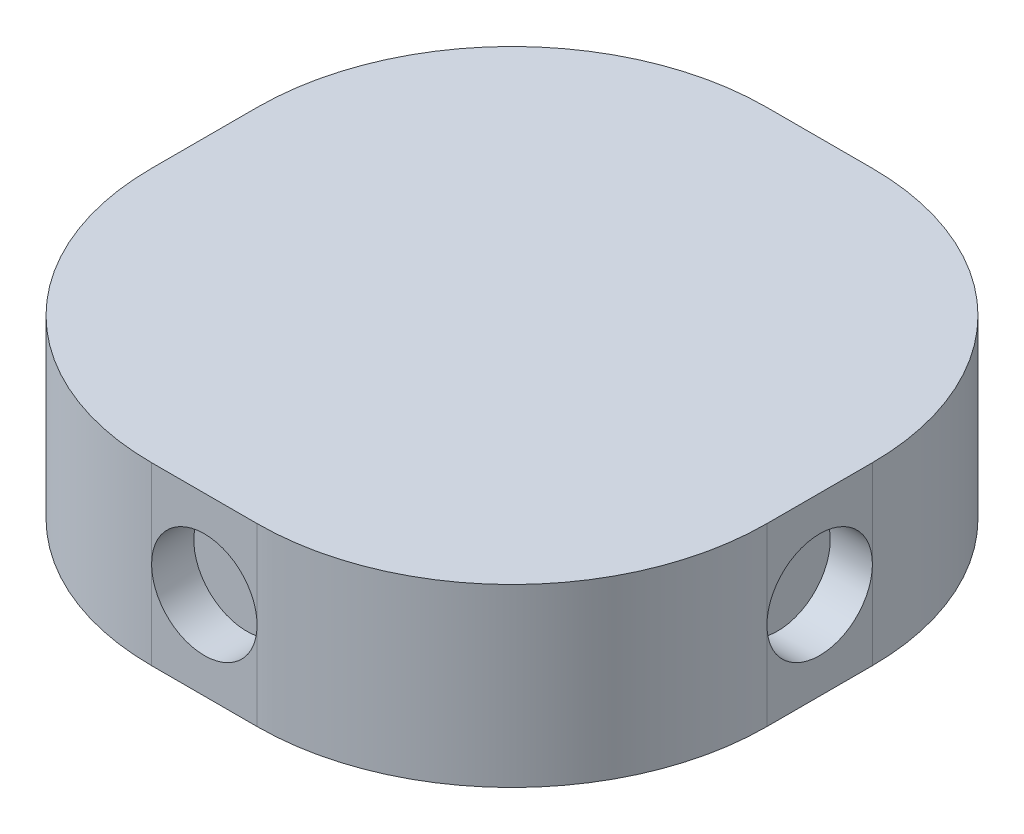
ISO-10303-21;
HEADER;
FILE_DESCRIPTION(('STEP AP214'),'2;1');
FILE_NAME('part.step','',(''),(''),'','','');
FILE_SCHEMA(('AUTOMOTIVE_DESIGN { 1 0 10303 214 1 1 1 1 }'));
ENDSEC;
DATA;
#1=APPLICATION_CONTEXT('core data for automotive mechanical design processes');
#2=APPLICATION_PROTOCOL_DEFINITION('international standard','automotive_design',2000,#1);
#3=PRODUCT_CONTEXT('',#1,'mechanical');
#4=PRODUCT('Part','Part','',(#3));
#5=PRODUCT_RELATED_PRODUCT_CATEGORY('part','',(#4));
#6=PRODUCT_DEFINITION_FORMATION('','',#4);
#7=PRODUCT_DEFINITION_CONTEXT('part definition',#1,'design');
#8=PRODUCT_DEFINITION('design','',#6,#7);
#9=PRODUCT_DEFINITION_SHAPE('','',#8);
#10=(LENGTH_UNIT() NAMED_UNIT(*) SI_UNIT(.MILLI.,.METRE.));
#11=(NAMED_UNIT(*) PLANE_ANGLE_UNIT() SI_UNIT($,.RADIAN.));
#12=(NAMED_UNIT(*) SI_UNIT($,.STERADIAN.) SOLID_ANGLE_UNIT());
#13=UNCERTAINTY_MEASURE_WITH_UNIT(LENGTH_MEASURE(1.E-05),#10,'distance_accuracy_value','');
#14=(GEOMETRIC_REPRESENTATION_CONTEXT(3) GLOBAL_UNCERTAINTY_ASSIGNED_CONTEXT((#13)) GLOBAL_UNIT_ASSIGNED_CONTEXT((#10,
#11,#12)) REPRESENTATION_CONTEXT('',''));
#15=CARTESIAN_POINT('',(0.,0.,0.));
#16=DIRECTION('',(0.,0.,1.));
#17=DIRECTION('',(1.,0.,0.));
#18=AXIS2_PLACEMENT_3D('',#15,#16,#17);
#19=CARTESIAN_POINT('',(-128.067602033553,5.,163.739757522464));
#20=DIRECTION('',(0.,0.,-1.));
#21=DIRECTION('',(-1.,0.,0.));
#22=AXIS2_PLACEMENT_3D('',#19,#20,#21);
#23=PLANE('',#22);
#24=DIRECTION('',(0.,-1.,0.));
#25=VECTOR('',#24,1.);
#26=CARTESIAN_POINT('',(-128.067602033553,5.,163.739757522464));
#27=LINE('',#26,#25);
#28=CARTESIAN_POINT('',(-128.067602033553,5.,163.739757522464));
#29=VERTEX_POINT('',#28);
#30=CARTESIAN_POINT('',(-128.067602033553,2.5,163.739757522464));
#31=VERTEX_POINT('',#30);
#32=EDGE_CURVE('E133',#29,#31,#27,.T.);
#33=ORIENTED_EDGE('',*,*,#32,.T.);
#34=CARTESIAN_POINT('',(-126.567602033553,2.5,163.739757522464));
#35=DIRECTION('',(0.,0.,1.));
#36=DIRECTION('',(1.,0.,0.));
#37=AXIS2_PLACEMENT_3D('',#34,#35,#36);
#38=CIRCLE('',#37,1.5);
#39=CARTESIAN_POINT('',(-125.067602033553,2.5,163.739757522464));
#40=VERTEX_POINT('',#39);
#41=EDGE_CURVE('E47',#40,#31,#38,.T.);
#42=ORIENTED_EDGE('',*,*,#41,.F.);
#43=DIRECTION('',(0.,-1.,0.));
#44=VECTOR('',#43,1.);
#45=CARTESIAN_POINT('',(-125.067602033553,5.,163.739757522464));
#46=LINE('',#45,#44);
#47=CARTESIAN_POINT('',(-125.067602033553,5.,163.739757522464));
#48=VERTEX_POINT('',#47);
#49=EDGE_CURVE('E130',#48,#40,#46,.T.);
#50=ORIENTED_EDGE('',*,*,#49,.F.);
#51=DIRECTION('',(1.,0.,0.));
#52=VECTOR('',#51,1.);
#53=CARTESIAN_POINT('',(-128.067602033553,5.,163.739757522464));
#54=LINE('',#53,#52);
#55=EDGE_CURVE('E242',#29,#48,#54,.T.);
#56=ORIENTED_EDGE('',*,*,#55,.F.);
#57=EDGE_LOOP('',(#33,#42,#50,#56));
#58=FACE_BOUND('',#57,.T.);
#59=ADVANCED_FACE('F33',(#58),#23,.F.);
#60=CARTESIAN_POINT('',(-135.317602033553,5.,156.489757522464));
#61=DIRECTION('',(1.,0.,0.));
#62=DIRECTION('',(0.,0.,-1.));
#63=AXIS2_PLACEMENT_3D('',#60,#61,#62);
#64=PLANE('',#63);
#65=DIRECTION('',(0.,-1.,0.));
#66=VECTOR('',#65,1.);
#67=CARTESIAN_POINT('',(-135.317602033553,5.,153.489757522464));
#68=LINE('',#67,#66);
#69=CARTESIAN_POINT('',(-135.317602033553,5.,153.489757522464));
#70=VERTEX_POINT('',#69);
#71=CARTESIAN_POINT('',(-135.317602033553,2.5,153.489757522464));
#72=VERTEX_POINT('',#71);
#73=EDGE_CURVE('E41',#70,#72,#68,.T.);
#74=ORIENTED_EDGE('',*,*,#73,.T.);
#75=CARTESIAN_POINT('',(-135.317602033553,2.5,154.989757522464));
#76=DIRECTION('',(-1.,0.,0.));
#77=DIRECTION('',(0.,0.,1.));
#78=AXIS2_PLACEMENT_3D('',#75,#76,#77);
#79=CIRCLE('',#78,1.50000000000003);
#80=CARTESIAN_POINT('',(-135.317602033553,2.5,156.489757522464));
#81=VERTEX_POINT('',#80);
#82=EDGE_CURVE('E54',#81,#72,#79,.T.);
#83=ORIENTED_EDGE('',*,*,#82,.F.);
#84=DIRECTION('',(0.,-1.,0.));
#85=VECTOR('',#84,1.);
#86=CARTESIAN_POINT('',(-135.317602033553,5.,156.489757522464));
#87=LINE('',#86,#85);
#88=CARTESIAN_POINT('',(-135.317602033553,5.,156.489757522464));
#89=VERTEX_POINT('',#88);
#90=EDGE_CURVE('E154',#89,#81,#87,.T.);
#91=ORIENTED_EDGE('',*,*,#90,.F.);
#92=DIRECTION('',(0.,0.,1.));
#93=VECTOR('',#92,1.);
#94=CARTESIAN_POINT('',(-135.317602033553,5.,156.489757522464));
#95=LINE('',#94,#93);
#96=EDGE_CURVE('E246',#70,#89,#95,.T.);
#97=ORIENTED_EDGE('',*,*,#96,.F.);
#98=EDGE_LOOP('',(#74,#83,#91,#97));
#99=FACE_BOUND('',#98,.T.);
#100=ADVANCED_FACE('F265',(#99),#64,.F.);
#101=CARTESIAN_POINT('',(-117.817602033553,5.,156.489757522464));
#102=DIRECTION('',(-1.,0.,0.));
#103=DIRECTION('',(0.,0.,1.));
#104=AXIS2_PLACEMENT_3D('',#101,#102,#103);
#105=PLANE('',#104);
#106=DIRECTION('',(0.,-1.,0.));
#107=VECTOR('',#106,1.);
#108=CARTESIAN_POINT('',(-117.817602033553,5.,156.489757522464));
#109=LINE('',#108,#107);
#110=CARTESIAN_POINT('',(-117.817602033553,5.,156.489757522464));
#111=VERTEX_POINT('',#110);
#112=CARTESIAN_POINT('',(-117.817602033553,2.5,156.489757522464));
#113=VERTEX_POINT('',#112);
#114=EDGE_CURVE('E143',#111,#113,#109,.T.);
#115=ORIENTED_EDGE('',*,*,#114,.T.);
#116=CARTESIAN_POINT('',(-117.817602033553,2.5,154.989757522464));
#117=DIRECTION('',(1.,0.,0.));
#118=DIRECTION('',(0.,0.,-1.));
#119=AXIS2_PLACEMENT_3D('',#116,#117,#118);
#120=CIRCLE('',#119,1.50000000000003);
#121=CARTESIAN_POINT('',(-117.817602033553,2.5,153.489757522464));
#122=VERTEX_POINT('',#121);
#123=EDGE_CURVE('E251',#122,#113,#120,.T.);
#124=ORIENTED_EDGE('',*,*,#123,.F.);
#125=DIRECTION('',(0.,-1.,0.));
#126=VECTOR('',#125,1.);
#127=CARTESIAN_POINT('',(-117.817602033553,5.,153.489757522464));
#128=LINE('',#127,#126);
#129=CARTESIAN_POINT('',(-117.817602033553,5.,153.489757522464));
#130=VERTEX_POINT('',#129);
#131=EDGE_CURVE('E211',#130,#122,#128,.T.);
#132=ORIENTED_EDGE('',*,*,#131,.F.);
#133=DIRECTION('',(0.,0.,-1.));
#134=VECTOR('',#133,1.);
#135=CARTESIAN_POINT('',(-117.817602033553,5.,156.489757522464));
#136=LINE('',#135,#134);
#137=EDGE_CURVE('E238',#111,#130,#136,.T.);
#138=ORIENTED_EDGE('',*,*,#137,.F.);
#139=EDGE_LOOP('',(#115,#124,#132,#138));
#140=FACE_BOUND('',#139,.T.);
#141=ADVANCED_FACE('F274',(#140),#105,.F.);
#142=CARTESIAN_POINT('',(-128.067602033553,5.,146.239757522464));
#143=DIRECTION('',(0.,0.,1.));
#144=DIRECTION('',(1.,0.,0.));
#145=AXIS2_PLACEMENT_3D('',#142,#143,#144);
#146=PLANE('',#145);
#147=DIRECTION('',(0.,-1.,0.));
#148=VECTOR('',#147,1.);
#149=CARTESIAN_POINT('',(-125.067602033553,5.,146.239757522464));
#150=LINE('',#149,#148);
#151=CARTESIAN_POINT('',(-125.067602033553,5.,146.239757522464));
#152=VERTEX_POINT('',#151);
#153=CARTESIAN_POINT('',(-125.067602033553,2.5,146.239757522464));
#154=VERTEX_POINT('',#153);
#155=EDGE_CURVE('E208',#152,#154,#150,.T.);
#156=ORIENTED_EDGE('',*,*,#155,.T.);
#157=CARTESIAN_POINT('',(-126.567602033553,2.5,146.239757522464));
#158=DIRECTION('',(0.,0.,-1.));
#159=DIRECTION('',(-1.,0.,0.));
#160=AXIS2_PLACEMENT_3D('',#157,#158,#159);
#161=CIRCLE('',#160,1.5);
#162=CARTESIAN_POINT('',(-128.067602033553,2.5,146.239757522464));
#163=VERTEX_POINT('',#162);
#164=EDGE_CURVE('E186',#163,#154,#161,.T.);
#165=ORIENTED_EDGE('',*,*,#164,.F.);
#166=DIRECTION('',(0.,-1.,0.));
#167=VECTOR('',#166,1.);
#168=CARTESIAN_POINT('',(-128.067602033553,5.,146.239757522464));
#169=LINE('',#168,#167);
#170=CARTESIAN_POINT('',(-128.067602033553,5.,146.239757522464));
#171=VERTEX_POINT('',#170);
#172=EDGE_CURVE('E205',#171,#163,#169,.T.);
#173=ORIENTED_EDGE('',*,*,#172,.F.);
#174=DIRECTION('',(-1.,0.,0.));
#175=VECTOR('',#174,1.);
#176=CARTESIAN_POINT('',(-128.067602033553,5.,146.239757522464));
#177=LINE('',#176,#175);
#178=EDGE_CURVE('E189',#152,#171,#177,.T.);
#179=ORIENTED_EDGE('',*,*,#178,.F.);
#180=EDGE_LOOP('',(#156,#165,#173,#179));
#181=FACE_BOUND('',#180,.T.);
#182=ADVANCED_FACE('F232',(#181),#146,.F.);
#183=CARTESIAN_POINT('',(-128.067602033553,5.,153.489757522464));
#184=DIRECTION('',(0.,-1.,0.));
#185=DIRECTION('',(0.,0.,-1.));
#186=AXIS2_PLACEMENT_3D('',#183,#184,#185);
#187=CYLINDRICAL_SURFACE('',#186,7.25000000000001);
#188=CARTESIAN_POINT('',(-128.067602033553,0.,153.489757522464));
#189=DIRECTION('',(0.,1.,0.));
#190=DIRECTION('',(0.,0.,-1.));
#191=AXIS2_PLACEMENT_3D('',#188,#189,#190);
#192=CIRCLE('',#191,7.25000000000001);
#193=CARTESIAN_POINT('',(-128.067602033553,0.,146.239757522464));
#194=VERTEX_POINT('',#193);
#195=CARTESIAN_POINT('',(-135.317602033553,0.,153.489757522464));
#196=VERTEX_POINT('',#195);
#197=EDGE_CURVE('E175',#194,#196,#192,.T.);
#198=ORIENTED_EDGE('',*,*,#197,.T.);
#199=EDGE_CURVE('E156',#72,#196,#68,.T.);
#200=ORIENTED_EDGE('',*,*,#199,.F.);
#201=ORIENTED_EDGE('',*,*,#73,.F.);
#202=CARTESIAN_POINT('',(-128.067602033553,5.,153.489757522464));
#203=DIRECTION('',(0.,1.,0.));
#204=DIRECTION('',(0.,0.,-1.));
#205=AXIS2_PLACEMENT_3D('',#202,#203,#204);
#206=CIRCLE('',#205,7.25000000000001);
#207=EDGE_CURVE('E204',#171,#70,#206,.T.);
#208=ORIENTED_EDGE('',*,*,#207,.F.);
#209=ORIENTED_EDGE('',*,*,#172,.T.);
#210=EDGE_CURVE('E181',#163,#194,#169,.T.);
#211=ORIENTED_EDGE('',*,*,#210,.T.);
#212=EDGE_LOOP('',(#198,#200,#201,#208,#209,#211));
#213=FACE_BOUND('',#212,.T.);
#214=ADVANCED_FACE('F35',(#213),#187,.T.);
#215=CARTESIAN_POINT('',(-135.317602033553,0.,156.489757522464));
#216=VERTEX_POINT('',#215);
#217=EDGE_CURVE('E153',#81,#216,#87,.T.);
#218=ORIENTED_EDGE('',*,*,#217,.F.);
#219=EDGE_CURVE('E168',#72,#81,#79,.T.);
#220=ORIENTED_EDGE('',*,*,#219,.F.);
#221=ORIENTED_EDGE('',*,*,#199,.T.);
#222=DIRECTION('',(0.,0.,1.));
#223=VECTOR('',#222,1.);
#224=CARTESIAN_POINT('',(-135.317602033553,0.,156.489757522464));
#225=LINE('',#224,#223);
#226=EDGE_CURVE('E166',#196,#216,#225,.T.);
#227=ORIENTED_EDGE('',*,*,#226,.T.);
#228=EDGE_LOOP('',(#218,#220,#221,#227));
#229=FACE_BOUND('',#228,.T.);
#230=ADVANCED_FACE('F165',(#229),#64,.F.);
#231=CARTESIAN_POINT('',(-128.067602033553,5.,156.489757522464));
#232=DIRECTION('',(0.,-1.,0.));
#233=DIRECTION('',(0.,0.,-1.));
#234=AXIS2_PLACEMENT_3D('',#231,#232,#233);
#235=CYLINDRICAL_SURFACE('',#234,7.25000000000001);
#236=CARTESIAN_POINT('',(-128.067602033553,0.,156.489757522464));
#237=DIRECTION('',(0.,1.,0.));
#238=DIRECTION('',(0.,0.,-1.));
#239=AXIS2_PLACEMENT_3D('',#236,#237,#238);
#240=CIRCLE('',#239,7.25000000000001);
#241=CARTESIAN_POINT('',(-128.067602033553,0.,163.739757522464));
#242=VERTEX_POINT('',#241);
#243=EDGE_CURVE('E177',#216,#242,#240,.T.);
#244=ORIENTED_EDGE('',*,*,#243,.T.);
#245=EDGE_CURVE('E148',#31,#242,#27,.T.);
#246=ORIENTED_EDGE('',*,*,#245,.F.);
#247=ORIENTED_EDGE('',*,*,#32,.F.);
#248=CARTESIAN_POINT('',(-128.067602033553,5.,156.489757522464));
#249=DIRECTION('',(0.,1.,0.));
#250=DIRECTION('',(0.,0.,-1.));
#251=AXIS2_PLACEMENT_3D('',#248,#249,#250);
#252=CIRCLE('',#251,7.25000000000001);
#253=EDGE_CURVE('E244',#89,#29,#252,.T.);
#254=ORIENTED_EDGE('',*,*,#253,.F.);
#255=ORIENTED_EDGE('',*,*,#90,.T.);
#256=ORIENTED_EDGE('',*,*,#217,.T.);
#257=EDGE_LOOP('',(#244,#246,#247,#254,#255,#256));
#258=FACE_BOUND('',#257,.T.);
#259=ADVANCED_FACE('F268',(#258),#235,.T.);
#260=CARTESIAN_POINT('',(-125.067602033553,0.,163.739757522464));
#261=VERTEX_POINT('',#260);
#262=EDGE_CURVE('E136',#40,#261,#46,.T.);
#263=ORIENTED_EDGE('',*,*,#262,.F.);
#264=EDGE_CURVE('E119',#31,#40,#38,.T.);
#265=ORIENTED_EDGE('',*,*,#264,.F.);
#266=ORIENTED_EDGE('',*,*,#245,.T.);
#267=DIRECTION('',(1.,0.,0.));
#268=VECTOR('',#267,1.);
#269=CARTESIAN_POINT('',(-128.067602033553,0.,163.739757522464));
#270=LINE('',#269,#268);
#271=EDGE_CURVE('E139',#242,#261,#270,.T.);
#272=ORIENTED_EDGE('',*,*,#271,.T.);
#273=EDGE_LOOP('',(#263,#265,#266,#272));
#274=FACE_BOUND('',#273,.T.);
#275=ADVANCED_FACE('F137',(#274),#23,.F.);
#276=CARTESIAN_POINT('',(-125.067602033553,5.,156.489757522464));
#277=DIRECTION('',(0.,-1.,0.));
#278=DIRECTION('',(0.,0.,-1.));
#279=AXIS2_PLACEMENT_3D('',#276,#277,#278);
#280=CYLINDRICAL_SURFACE('',#279,7.25);
#281=CARTESIAN_POINT('',(-125.067602033553,0.,156.489757522464));
#282=DIRECTION('',(0.,1.,0.));
#283=DIRECTION('',(0.,0.,1.));
#284=AXIS2_PLACEMENT_3D('',#281,#282,#283);
#285=CIRCLE('',#284,7.25);
#286=CARTESIAN_POINT('',(-117.817602033553,0.,156.489757522464));
#287=VERTEX_POINT('',#286);
#288=EDGE_CURVE('E194',#261,#287,#285,.T.);
#289=ORIENTED_EDGE('',*,*,#288,.T.);
#290=EDGE_CURVE('E213',#113,#287,#109,.T.);
#291=ORIENTED_EDGE('',*,*,#290,.F.);
#292=ORIENTED_EDGE('',*,*,#114,.F.);
#293=CARTESIAN_POINT('',(-125.067602033553,5.,156.489757522464));
#294=DIRECTION('',(0.,1.,0.));
#295=DIRECTION('',(0.,0.,1.));
#296=AXIS2_PLACEMENT_3D('',#293,#294,#295);
#297=CIRCLE('',#296,7.25);
#298=EDGE_CURVE('E147',#48,#111,#297,.T.);
#299=ORIENTED_EDGE('',*,*,#298,.F.);
#300=ORIENTED_EDGE('',*,*,#49,.T.);
#301=ORIENTED_EDGE('',*,*,#262,.T.);
#302=EDGE_LOOP('',(#289,#291,#292,#299,#300,#301));
#303=FACE_BOUND('',#302,.T.);
#304=ADVANCED_FACE('F145',(#303),#280,.T.);
#305=CARTESIAN_POINT('',(-117.817602033553,0.,153.489757522464));
#306=VERTEX_POINT('',#305);
#307=EDGE_CURVE('E210',#122,#306,#128,.T.);
#308=ORIENTED_EDGE('',*,*,#307,.F.);
#309=EDGE_CURVE('E253',#113,#122,#120,.T.);
#310=ORIENTED_EDGE('',*,*,#309,.F.);
#311=ORIENTED_EDGE('',*,*,#290,.T.);
#312=DIRECTION('',(0.,0.,-1.));
#313=VECTOR('',#312,1.);
#314=CARTESIAN_POINT('',(-117.817602033553,0.,156.489757522464));
#315=LINE('',#314,#313);
#316=EDGE_CURVE('E196',#287,#306,#315,.T.);
#317=ORIENTED_EDGE('',*,*,#316,.T.);
#318=EDGE_LOOP('',(#308,#310,#311,#317));
#319=FACE_BOUND('',#318,.T.);
#320=ADVANCED_FACE('F224',(#319),#105,.F.);
#321=CARTESIAN_POINT('',(-125.067602033553,5.,153.489757522464));
#322=DIRECTION('',(0.,-1.,0.));
#323=DIRECTION('',(0.,0.,-1.));
#324=AXIS2_PLACEMENT_3D('',#321,#322,#323);
#325=CYLINDRICAL_SURFACE('',#324,7.25);
#326=CARTESIAN_POINT('',(-125.067602033553,0.,153.489757522464));
#327=DIRECTION('',(0.,1.,0.));
#328=DIRECTION('',(0.,0.,-1.));
#329=AXIS2_PLACEMENT_3D('',#326,#327,#328);
#330=CIRCLE('',#329,7.25);
#331=CARTESIAN_POINT('',(-125.067602033553,0.,146.239757522464));
#332=VERTEX_POINT('',#331);
#333=EDGE_CURVE('E199',#306,#332,#330,.T.);
#334=ORIENTED_EDGE('',*,*,#333,.T.);
#335=EDGE_CURVE('E207',#154,#332,#150,.T.);
#336=ORIENTED_EDGE('',*,*,#335,.F.);
#337=ORIENTED_EDGE('',*,*,#155,.F.);
#338=CARTESIAN_POINT('',(-125.067602033553,5.,153.489757522464));
#339=DIRECTION('',(0.,1.,0.));
#340=DIRECTION('',(0.,0.,-1.));
#341=AXIS2_PLACEMENT_3D('',#338,#339,#340);
#342=CIRCLE('',#341,7.25);
#343=EDGE_CURVE('E237',#130,#152,#342,.T.);
#344=ORIENTED_EDGE('',*,*,#343,.F.);
#345=ORIENTED_EDGE('',*,*,#131,.T.);
#346=ORIENTED_EDGE('',*,*,#307,.T.);
#347=EDGE_LOOP('',(#334,#336,#337,#344,#345,#346));
#348=FACE_BOUND('',#347,.T.);
#349=ADVANCED_FACE('F218',(#348),#325,.T.);
#350=ORIENTED_EDGE('',*,*,#210,.F.);
#351=CARTESIAN_POINT('',(-126.567602033553,2.5,146.239757522464));
#352=DIRECTION('',(0.,0.,1.));
#353=DIRECTION('',(1.,0.,0.));
#354=AXIS2_PLACEMENT_3D('',#351,#352,#353);
#355=CIRCLE('',#354,1.5);
#356=EDGE_CURVE('E11',#163,#154,#355,.T.);
#357=ORIENTED_EDGE('',*,*,#356,.T.);
#358=ORIENTED_EDGE('',*,*,#335,.T.);
#359=DIRECTION('',(-1.,0.,0.));
#360=VECTOR('',#359,1.);
#361=CARTESIAN_POINT('',(-128.067602033553,0.,146.239757522464));
#362=LINE('',#361,#360);
#363=EDGE_CURVE('E202',#332,#194,#362,.T.);
#364=ORIENTED_EDGE('',*,*,#363,.T.);
#365=EDGE_LOOP('',(#350,#357,#358,#364));
#366=FACE_BOUND('',#365,.T.);
#367=ADVANCED_FACE('F227',(#366),#146,.F.);
#368=CARTESIAN_POINT('',(-128.067602033553,5.,153.489757522464));
#369=DIRECTION('',(0.,-1.,0.));
#370=DIRECTION('',(0.,0.,-1.));
#371=AXIS2_PLACEMENT_3D('',#368,#369,#370);
#372=PLANE('',#371);
#373=ORIENTED_EDGE('',*,*,#207,.T.);
#374=ORIENTED_EDGE('',*,*,#96,.T.);
#375=ORIENTED_EDGE('',*,*,#253,.T.);
#376=ORIENTED_EDGE('',*,*,#55,.T.);
#377=ORIENTED_EDGE('',*,*,#298,.T.);
#378=ORIENTED_EDGE('',*,*,#137,.T.);
#379=ORIENTED_EDGE('',*,*,#343,.T.);
#380=ORIENTED_EDGE('',*,*,#178,.T.);
#381=EDGE_LOOP('',(#373,#374,#375,#376,#377,#378,#379,#380));
#382=FACE_BOUND('',#381,.T.);
#383=ADVANCED_FACE('F269',(#382),#372,.F.);
#384=CARTESIAN_POINT('',(-128.067602033553,0.,153.489757522464));
#385=DIRECTION('',(0.,-1.,0.));
#386=DIRECTION('',(0.,0.,-1.));
#387=AXIS2_PLACEMENT_3D('',#384,#385,#386);
#388=PLANE('',#387);
#389=ORIENTED_EDGE('',*,*,#197,.F.);
#390=ORIENTED_EDGE('',*,*,#363,.F.);
#391=ORIENTED_EDGE('',*,*,#333,.F.);
#392=ORIENTED_EDGE('',*,*,#316,.F.);
#393=ORIENTED_EDGE('',*,*,#288,.F.);
#394=ORIENTED_EDGE('',*,*,#271,.F.);
#395=ORIENTED_EDGE('',*,*,#243,.F.);
#396=ORIENTED_EDGE('',*,*,#226,.F.);
#397=EDGE_LOOP('',(#389,#390,#391,#392,#393,#394,#395,#396));
#398=FACE_BOUND('',#397,.T.);
#399=ADVANCED_FACE('F173',(#398),#388,.T.);
#400=CARTESIAN_POINT('',(-126.567602033553,2.5,147.439757522464));
#401=DIRECTION('',(0.,0.,-1.));
#402=DIRECTION('',(-1.,0.,0.));
#403=AXIS2_PLACEMENT_3D('',#400,#401,#402);
#404=CYLINDRICAL_SURFACE('',#403,1.5);
#405=CARTESIAN_POINT('',(-126.567602033553,2.5,147.439757522464));
#406=DIRECTION('',(0.,0.,-1.));
#407=DIRECTION('',(-1.,0.,0.));
#408=AXIS2_PLACEMENT_3D('',#405,#406,#407);
#409=CIRCLE('',#408,1.5);
#410=CARTESIAN_POINT('',(-128.067602033553,2.5,147.439757522464));
#411=VERTEX_POINT('',#410);
#412=EDGE_CURVE('E183',#411,#411,#409,.T.);
#413=ORIENTED_EDGE('',*,*,#412,.F.);
#414=EDGE_LOOP('',(#413));
#415=FACE_BOUND('',#414,.T.);
#416=ORIENTED_EDGE('',*,*,#164,.T.);
#417=ORIENTED_EDGE('',*,*,#356,.F.);
#418=EDGE_LOOP('',(#416,#417));
#419=FACE_BOUND('',#418,.T.);
#420=ADVANCED_FACE('F288',(#415,#419),#404,.F.);
#421=CARTESIAN_POINT('',(-126.567602033553,2.5,147.439757522464));
#422=DIRECTION('',(0.,0.,-1.));
#423=DIRECTION('',(-1.,0.,0.));
#424=AXIS2_PLACEMENT_3D('',#421,#422,#423);
#425=PLANE('',#424);
#426=ORIENTED_EDGE('',*,*,#412,.T.);
#427=EDGE_LOOP('',(#426));
#428=FACE_BOUND('',#427,.T.);
#429=ADVANCED_FACE('F279',(#428),#425,.T.);
#430=CARTESIAN_POINT('',(-119.017602033553,2.5,154.989757522464));
#431=DIRECTION('',(1.,0.,0.));
#432=DIRECTION('',(0.,0.,-1.));
#433=AXIS2_PLACEMENT_3D('',#430,#431,#432);
#434=CYLINDRICAL_SURFACE('',#433,1.50000000000003);
#435=CARTESIAN_POINT('',(-119.017602033553,2.5,154.989757522464));
#436=DIRECTION('',(1.,0.,0.));
#437=DIRECTION('',(0.,0.,-1.));
#438=AXIS2_PLACEMENT_3D('',#435,#436,#437);
#439=CIRCLE('',#438,1.50000000000003);
#440=CARTESIAN_POINT('',(-119.017602033553,2.5,153.489757522464));
#441=VERTEX_POINT('',#440);
#442=EDGE_CURVE('E249',#441,#441,#439,.T.);
#443=ORIENTED_EDGE('',*,*,#442,.F.);
#444=EDGE_LOOP('',(#443));
#445=FACE_BOUND('',#444,.T.);
#446=ORIENTED_EDGE('',*,*,#123,.T.);
#447=ORIENTED_EDGE('',*,*,#309,.T.);
#448=EDGE_LOOP('',(#446,#447));
#449=FACE_BOUND('',#448,.T.);
#450=ADVANCED_FACE('F276',(#445,#449),#434,.F.);
#451=CARTESIAN_POINT('',(-119.017602033553,2.5,154.989757522464));
#452=DIRECTION('',(1.,0.,0.));
#453=DIRECTION('',(0.,0.,-1.));
#454=AXIS2_PLACEMENT_3D('',#451,#452,#453);
#455=PLANE('',#454);
#456=ORIENTED_EDGE('',*,*,#442,.T.);
#457=EDGE_LOOP('',(#456));
#458=FACE_BOUND('',#457,.T.);
#459=ADVANCED_FACE('F278',(#458),#455,.T.);
#460=CARTESIAN_POINT('',(-134.117602033553,2.5,154.989757522464));
#461=DIRECTION('',(-1.,0.,0.));
#462=DIRECTION('',(0.,0.,1.));
#463=AXIS2_PLACEMENT_3D('',#460,#461,#462);
#464=CYLINDRICAL_SURFACE('',#463,1.50000000000003);
#465=CARTESIAN_POINT('',(-134.117602033553,2.5,154.989757522464));
#466=DIRECTION('',(-1.,0.,0.));
#467=DIRECTION('',(0.,0.,1.));
#468=AXIS2_PLACEMENT_3D('',#465,#466,#467);
#469=CIRCLE('',#468,1.50000000000003);
#470=CARTESIAN_POINT('',(-134.117602033553,2.5,156.489757522464));
#471=VERTEX_POINT('',#470);
#472=EDGE_CURVE('E257',#471,#471,#469,.T.);
#473=ORIENTED_EDGE('',*,*,#472,.F.);
#474=EDGE_LOOP('',(#473));
#475=FACE_BOUND('',#474,.T.);
#476=ORIENTED_EDGE('',*,*,#82,.T.);
#477=ORIENTED_EDGE('',*,*,#219,.T.);
#478=EDGE_LOOP('',(#476,#477));
#479=FACE_BOUND('',#478,.T.);
#480=ADVANCED_FACE('F263',(#475,#479),#464,.F.);
#481=CARTESIAN_POINT('',(-134.117602033553,2.5,154.989757522464));
#482=DIRECTION('',(-1.,0.,0.));
#483=DIRECTION('',(0.,0.,1.));
#484=AXIS2_PLACEMENT_3D('',#481,#482,#483);
#485=PLANE('',#484);
#486=ORIENTED_EDGE('',*,*,#472,.T.);
#487=EDGE_LOOP('',(#486));
#488=FACE_BOUND('',#487,.T.);
#489=ADVANCED_FACE('F348',(#488),#485,.T.);
#490=CARTESIAN_POINT('',(-126.567602033553,2.5,162.539757522464));
#491=DIRECTION('',(0.,0.,1.));
#492=DIRECTION('',(1.,0.,0.));
#493=AXIS2_PLACEMENT_3D('',#490,#491,#492);
#494=CYLINDRICAL_SURFACE('',#493,1.5);
#495=CARTESIAN_POINT('',(-126.567602033553,2.5,162.539757522464));
#496=DIRECTION('',(0.,0.,1.));
#497=DIRECTION('',(1.,0.,0.));
#498=AXIS2_PLACEMENT_3D('',#495,#496,#497);
#499=CIRCLE('',#498,1.5);
#500=CARTESIAN_POINT('',(-125.067602033553,2.5,162.539757522464));
#501=VERTEX_POINT('',#500);
#502=EDGE_CURVE('E134',#501,#501,#499,.T.);
#503=ORIENTED_EDGE('',*,*,#502,.F.);
#504=EDGE_LOOP('',(#503));
#505=FACE_BOUND('',#504,.T.);
#506=ORIENTED_EDGE('',*,*,#41,.T.);
#507=ORIENTED_EDGE('',*,*,#264,.T.);
#508=EDGE_LOOP('',(#506,#507));
#509=FACE_BOUND('',#508,.T.);
#510=ADVANCED_FACE('F120',(#505,#509),#494,.F.);
#511=CARTESIAN_POINT('',(-126.567602033553,2.5,162.539757522464));
#512=DIRECTION('',(0.,0.,1.));
#513=DIRECTION('',(1.,0.,0.));
#514=AXIS2_PLACEMENT_3D('',#511,#512,#513);
#515=PLANE('',#514);
#516=ORIENTED_EDGE('',*,*,#502,.T.);
#517=EDGE_LOOP('',(#516));
#518=FACE_BOUND('',#517,.T.);
#519=ADVANCED_FACE('F347',(#518),#515,.T.);
#520=CLOSED_SHELL('',(#59,#100,#141,#182,#214,#230,#259,#275,#304,#320,#349,#367,#383,#399,#420,
#429,#450,#459,#480,#489,#510,#519));
#521=MANIFOLD_SOLID_BREP('B2',#520);
#522=ADVANCED_BREP_SHAPE_REPRESENTATION('',(#18,#521),#14);
#523=SHAPE_DEFINITION_REPRESENTATION(#9,#522);
ENDSEC;
END-ISO-10303-21;
